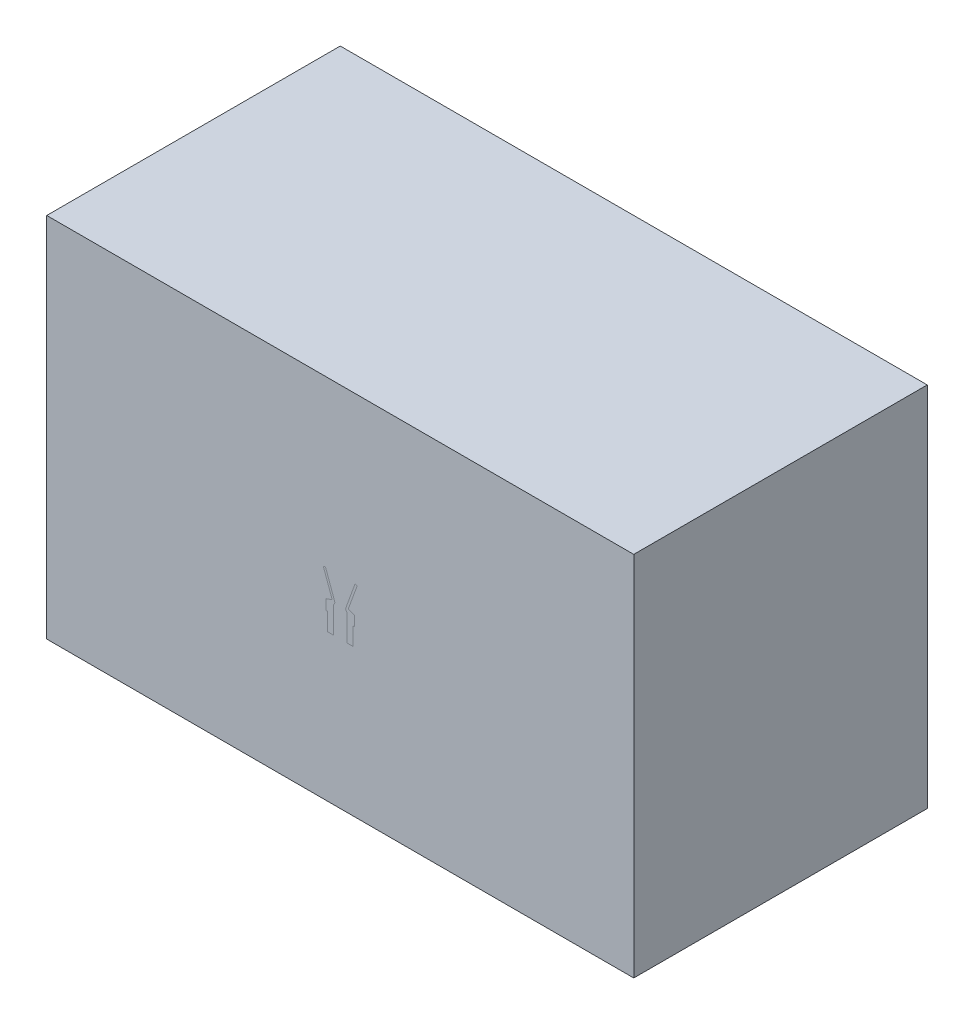
ISO-10303-21;
HEADER;
FILE_DESCRIPTION(('STEP AP214'),'2;1');
FILE_NAME('part.step','',(''),(''),'','','');
FILE_SCHEMA(('AUTOMOTIVE_DESIGN { 1 0 10303 214 1 1 1 1 }'));
ENDSEC;
DATA;
#1=APPLICATION_CONTEXT('core data for automotive mechanical design processes');
#2=APPLICATION_PROTOCOL_DEFINITION('international standard','automotive_design',2000,#1);
#3=PRODUCT_CONTEXT('',#1,'mechanical');
#4=PRODUCT('Part','Part','',(#3));
#5=PRODUCT_RELATED_PRODUCT_CATEGORY('part','',(#4));
#6=PRODUCT_DEFINITION_FORMATION('','',#4);
#7=PRODUCT_DEFINITION_CONTEXT('part definition',#1,'design');
#8=PRODUCT_DEFINITION('design','',#6,#7);
#9=PRODUCT_DEFINITION_SHAPE('','',#8);
#10=(LENGTH_UNIT() NAMED_UNIT(*) SI_UNIT(.MILLI.,.METRE.));
#11=(NAMED_UNIT(*) PLANE_ANGLE_UNIT() SI_UNIT($,.RADIAN.));
#12=(NAMED_UNIT(*) SI_UNIT($,.STERADIAN.) SOLID_ANGLE_UNIT());
#13=UNCERTAINTY_MEASURE_WITH_UNIT(LENGTH_MEASURE(1.E-05),#10,'distance_accuracy_value','');
#14=(GEOMETRIC_REPRESENTATION_CONTEXT(3) GLOBAL_UNCERTAINTY_ASSIGNED_CONTEXT((#13)) GLOBAL_UNIT_ASSIGNED_CONTEXT((#10,
#11,#12)) REPRESENTATION_CONTEXT('',''));
#15=CARTESIAN_POINT('',(0.,0.,0.));
#16=DIRECTION('',(0.,0.,1.));
#17=DIRECTION('',(1.,0.,0.));
#18=AXIS2_PLACEMENT_3D('',#15,#16,#17);
#19=CARTESIAN_POINT('',(0.,941.954291822987,0.));
#20=DIRECTION('',(0.,1.,0.));
#21=DIRECTION('',(0.,0.,1.));
#22=AXIS2_PLACEMENT_3D('',#19,#20,#21);
#23=TOROIDAL_SURFACE('',#22,265.023984913654,12.7);
#24=CARTESIAN_POINT('',(0.,946.297947643223,0.));
#25=DIRECTION('',(0.,-1.,0.));
#26=DIRECTION('',(0.,0.,-1.));
#27=AXIS2_PLACEMENT_3D('',#24,#25,#26);
#28=CIRCLE('',#27,253.089888629673);
#29=CARTESIAN_POINT('',(253.089888629673,946.297947643223,0.));
#30=VERTEX_POINT('',#29);
#31=CARTESIAN_POINT('',(-253.089888629673,946.297947643223,0.));
#32=VERTEX_POINT('',#31);
#33=EDGE_CURVE('E175',#30,#32,#28,.F.);
#34=ORIENTED_EDGE('',*,*,#33,.F.);
#35=CARTESIAN_POINT('',(265.023984913654,941.954291822987,0.));
#36=DIRECTION('',(0.,0.,1.));
#37=DIRECTION('',(1.,0.,0.));
#38=AXIS2_PLACEMENT_3D('',#35,#36,#37);
#39=CIRCLE('',#38,12.7);
#40=CARTESIAN_POINT('',(269.36764073389,953.888388106968,0.));
#41=VERTEX_POINT('',#40);
#42=EDGE_CURVE('E214',#30,#41,#39,.F.);
#43=ORIENTED_EDGE('',*,*,#42,.T.);
#44=CARTESIAN_POINT('',(0.,953.888388106968,0.));
#45=DIRECTION('',(0.,1.,0.));
#46=DIRECTION('',(0.,0.,1.));
#47=AXIS2_PLACEMENT_3D('',#44,#45,#46);
#48=CIRCLE('',#47,269.36764073389);
#49=CARTESIAN_POINT('',(-269.36764073389,953.888388106968,0.));
#50=VERTEX_POINT('',#49);
#51=EDGE_CURVE('E169',#50,#41,#48,.F.);
#52=ORIENTED_EDGE('',*,*,#51,.F.);
#53=CARTESIAN_POINT('',(-265.023984913654,941.954291822987,0.));
#54=DIRECTION('',(0.,0.,1.));
#55=DIRECTION('',(1.,0.,0.));
#56=AXIS2_PLACEMENT_3D('',#53,#54,#55);
#57=CIRCLE('',#56,12.7);
#58=EDGE_CURVE('E177',#50,#32,#57,.F.);
#59=ORIENTED_EDGE('',*,*,#58,.T.);
#60=EDGE_LOOP('',(#34,#43,#52,#59));
#61=FACE_BOUND('',#60,.T.);
#62=ADVANCED_FACE('F53',(#61),#23,.T.);
#63=CARTESIAN_POINT('',(0.,937.610636002752,0.));
#64=DIRECTION('',(0.,1.,0.));
#65=DIRECTION('',(0.,0.,1.));
#66=AXIS2_PLACEMENT_3D('',#63,#64,#65);
#67=TOROIDAL_SURFACE('',#66,276.958081197635,12.7);
#68=CARTESIAN_POINT('',(0.,949.544732286733,0.));
#69=DIRECTION('',(0.,1.,0.));
#70=DIRECTION('',(0.,0.,1.));
#71=AXIS2_PLACEMENT_3D('',#68,#69,#70);
#72=CIRCLE('',#71,281.301737017871);
#73=CARTESIAN_POINT('',(281.301737017871,949.544732286733,0.));
#74=VERTEX_POINT('',#73);
#75=CARTESIAN_POINT('',(-281.301737017871,949.544732286733,0.));
#76=VERTEX_POINT('',#75);
#77=EDGE_CURVE('E172',#74,#76,#72,.T.);
#78=ORIENTED_EDGE('',*,*,#77,.F.);
#79=CARTESIAN_POINT('',(276.958081197635,937.610636002752,0.));
#80=DIRECTION('',(0.,0.,1.));
#81=DIRECTION('',(1.,0.,0.));
#82=AXIS2_PLACEMENT_3D('',#79,#80,#81);
#83=CIRCLE('',#82,12.7);
#84=CARTESIAN_POINT('',(288.892177481616,933.266980182516,0.));
#85=VERTEX_POINT('',#84);
#86=EDGE_CURVE('E242',#74,#85,#83,.F.);
#87=ORIENTED_EDGE('',*,*,#86,.T.);
#88=CARTESIAN_POINT('',(0.,933.266980182516,0.));
#89=DIRECTION('',(0.,-1.,0.));
#90=DIRECTION('',(0.,0.,-1.));
#91=AXIS2_PLACEMENT_3D('',#88,#89,#90);
#92=CIRCLE('',#91,288.892177481616);
#93=CARTESIAN_POINT('',(-288.892177481616,933.266980182516,0.));
#94=VERTEX_POINT('',#93);
#95=EDGE_CURVE('E163',#94,#85,#92,.T.);
#96=ORIENTED_EDGE('',*,*,#95,.F.);
#97=CARTESIAN_POINT('',(-276.958081197635,937.610636002752,0.));
#98=DIRECTION('',(0.,0.,1.));
#99=DIRECTION('',(1.,0.,0.));
#100=AXIS2_PLACEMENT_3D('',#97,#98,#99);
#101=CIRCLE('',#100,12.7);
#102=EDGE_CURVE('E226',#94,#76,#101,.F.);
#103=ORIENTED_EDGE('',*,*,#102,.T.);
#104=EDGE_LOOP('',(#78,#87,#96,#103));
#105=FACE_BOUND('',#104,.T.);
#106=ADVANCED_FACE('F235',(#105),#67,.T.);
#107=CARTESIAN_POINT('',(0.,501.45218115623,0.));
#108=DIRECTION('',(0.,-1.,0.));
#109=DIRECTION('',(0.,0.,-1.));
#110=AXIS2_PLACEMENT_3D('',#107,#108,#109);
#111=TOROIDAL_SURFACE('',#110,145.239501630853,50.8);
#112=CARTESIAN_POINT('',(0.,518.826804437174,0.));
#113=DIRECTION('',(0.,-1.,0.));
#114=DIRECTION('',(0.,0.,-1.));
#115=AXIS2_PLACEMENT_3D('',#112,#113,#114);
#116=CIRCLE('',#115,97.5031164949284);
#117=CARTESIAN_POINT('',(-97.5031164949284,518.826804437174,0.));
#118=VERTEX_POINT('',#117);
#119=CARTESIAN_POINT('',(97.5031164949284,518.826804437174,0.));
#120=VERTEX_POINT('',#119);
#121=EDGE_CURVE('E158',#118,#120,#116,.T.);
#122=ORIENTED_EDGE('',*,*,#121,.F.);
#123=CARTESIAN_POINT('',(-145.239501630853,501.45218115623,0.));
#124=DIRECTION('',(0.,0.,1.));
#125=DIRECTION('',(1.,0.,0.));
#126=AXIS2_PLACEMENT_3D('',#123,#124,#125);
#127=CIRCLE('',#126,50.8);
#128=CARTESIAN_POINT('',(-120.65,457.,0.));
#129=VERTEX_POINT('',#128);
#130=EDGE_CURVE('E224',#118,#129,#127,.F.);
#131=ORIENTED_EDGE('',*,*,#130,.T.);
#132=CARTESIAN_POINT('',(0.,457.,0.));
#133=DIRECTION('',(0.,1.,0.));
#134=DIRECTION('',(0.,0.,1.));
#135=AXIS2_PLACEMENT_3D('',#132,#133,#134);
#136=CIRCLE('',#135,120.65);
#137=CARTESIAN_POINT('',(120.65,457.,0.));
#138=VERTEX_POINT('',#137);
#139=EDGE_CURVE('E197',#138,#129,#136,.T.);
#140=ORIENTED_EDGE('',*,*,#139,.F.);
#141=CARTESIAN_POINT('',(145.239501630853,501.45218115623,0.));
#142=DIRECTION('',(0.,0.,1.));
#143=DIRECTION('',(1.,0.,0.));
#144=AXIS2_PLACEMENT_3D('',#141,#142,#143);
#145=CIRCLE('',#144,50.8);
#146=EDGE_CURVE('E244',#138,#120,#145,.F.);
#147=ORIENTED_EDGE('',*,*,#146,.T.);
#148=EDGE_LOOP('',(#122,#131,#140,#147));
#149=FACE_BOUND('',#148,.T.);
#150=ADVANCED_FACE('F281',(#149),#111,.T.);
#151=CARTESIAN_POINT('',(0.,457.,0.));
#152=DIRECTION('',(0.,1.,0.));
#153=DIRECTION('',(0.,0.,1.));
#154=AXIS2_PLACEMENT_3D('',#151,#152,#153);
#155=CONICAL_SURFACE('',#154,75.,0.349065850398861);
#156=DIRECTION('',(0.342020143325664,0.93969262078591,0.));
#157=VECTOR('',#156,1.);
#158=CARTESIAN_POINT('',(0.,250.9391935409,0.));
#159=LINE('',#158,#157);
#160=EDGE_CURVE('E241',#30,#120,#159,.F.);
#161=ORIENTED_EDGE('',*,*,#160,.F.);
#162=ORIENTED_EDGE('',*,*,#33,.T.);
#163=DIRECTION('',(0.342020143325664,-0.93969262078591,0.));
#164=VECTOR('',#163,1.);
#165=CARTESIAN_POINT('',(0.,250.9391935409,0.));
#166=LINE('',#165,#164);
#167=EDGE_CURVE('E183',#118,#32,#166,.F.);
#168=ORIENTED_EDGE('',*,*,#167,.F.);
#169=ORIENTED_EDGE('',*,*,#121,.T.);
#170=EDGE_LOOP('',(#161,#162,#168,#169));
#171=FACE_BOUND('',#170,.T.);
#172=ADVANCED_FACE('F273',(#171),#155,.F.);
#173=CARTESIAN_POINT('',(0.,958.232043927204,0.));
#174=DIRECTION('',(0.,-1.,0.));
#175=DIRECTION('',(0.,0.,-1.));
#176=AXIS2_PLACEMENT_3D('',#173,#174,#175);
#177=CONICAL_SURFACE('',#176,257.433544449909,1.22173047639604);
#178=DIRECTION('',(-0.93969262078591,-0.342020143325664,0.));
#179=VECTOR('',#178,1.);
#180=CARTESIAN_POINT('',(0.,1051.93019140862,0.));
#181=LINE('',#180,#179);
#182=EDGE_CURVE('E187',#50,#76,#181,.T.);
#183=ORIENTED_EDGE('',*,*,#182,.F.);
#184=ORIENTED_EDGE('',*,*,#51,.T.);
#185=DIRECTION('',(-0.93969262078591,0.342020143325664,0.));
#186=VECTOR('',#185,1.);
#187=CARTESIAN_POINT('',(0.,1051.93019140862,0.));
#188=LINE('',#187,#186);
#189=EDGE_CURVE('E239',#74,#41,#188,.T.);
#190=ORIENTED_EDGE('',*,*,#189,.F.);
#191=ORIENTED_EDGE('',*,*,#77,.T.);
#192=EDGE_LOOP('',(#183,#184,#190,#191));
#193=FACE_BOUND('',#192,.T.);
#194=ADVANCED_FACE('F238',(#193),#177,.T.);
#195=CARTESIAN_POINT('',(0.,945.201076466497,0.));
#196=DIRECTION('',(0.,1.,0.));
#197=DIRECTION('',(0.,0.,1.));
#198=AXIS2_PLACEMENT_3D('',#195,#196,#197);
#199=CONICAL_SURFACE('',#198,293.235833301852,0.34906585039886);
#200=DIRECTION('',(0.342020143325663,0.93969262078591,0.));
#201=VECTOR('',#200,1.);
#202=CARTESIAN_POINT('',(0.,139.542245894684,0.));
#203=LINE('',#202,#201);
#204=CARTESIAN_POINT('',(138.974740497211,521.372207285344,0.));
#205=VERTEX_POINT('',#204);
#206=EDGE_CURVE('E249',#205,#85,#203,.T.);
#207=ORIENTED_EDGE('',*,*,#206,.F.);
#208=CARTESIAN_POINT('',(0.,521.372207285344,0.));
#209=DIRECTION('',(0.,-1.,0.));
#210=DIRECTION('',(0.,0.,-1.));
#211=AXIS2_PLACEMENT_3D('',#208,#209,#210);
#212=CIRCLE('',#211,138.974740497211);
#213=CARTESIAN_POINT('',(-138.974740497211,521.372207285344,0.));
#214=VERTEX_POINT('',#213);
#215=EDGE_CURVE('E146',#214,#205,#212,.T.);
#216=ORIENTED_EDGE('',*,*,#215,.F.);
#217=DIRECTION('',(0.342020143325663,-0.93969262078591,0.));
#218=VECTOR('',#217,1.);
#219=CARTESIAN_POINT('',(0.,139.542245894684,0.));
#220=LINE('',#219,#218);
#221=EDGE_CURVE('E222',#94,#214,#220,.T.);
#222=ORIENTED_EDGE('',*,*,#221,.F.);
#223=ORIENTED_EDGE('',*,*,#95,.T.);
#224=EDGE_LOOP('',(#207,#216,#222,#223));
#225=FACE_BOUND('',#224,.T.);
#226=ADVANCED_FACE('F265',(#225),#199,.T.);
#227=CARTESIAN_POINT('',(0.,521.372207285344,0.));
#228=DIRECTION('',(0.,-1.,0.));
#229=DIRECTION('',(0.,0.,-1.));
#230=AXIS2_PLACEMENT_3D('',#227,#228,#229);
#231=CONICAL_SURFACE('',#230,138.974740497211,1.22173047639604);
#232=DIRECTION('',(-0.93969262078591,-0.342020143325664,0.));
#233=VECTOR('',#232,1.);
#234=CARTESIAN_POINT('',(0.,571.954876141198,0.));
#235=LINE('',#234,#233);
#236=CARTESIAN_POINT('',(-246.05,482.4,0.));
#237=VERTEX_POINT('',#236);
#238=EDGE_CURVE('E220',#214,#237,#235,.T.);
#239=ORIENTED_EDGE('',*,*,#238,.F.);
#240=ORIENTED_EDGE('',*,*,#215,.T.);
#241=DIRECTION('',(-0.93969262078591,0.342020143325664,0.));
#242=VECTOR('',#241,1.);
#243=CARTESIAN_POINT('',(0.,571.954876141198,0.));
#244=LINE('',#243,#242);
#245=CARTESIAN_POINT('',(246.05,482.4,0.));
#246=VERTEX_POINT('',#245);
#247=EDGE_CURVE('E251',#246,#205,#244,.T.);
#248=ORIENTED_EDGE('',*,*,#247,.F.);
#249=CARTESIAN_POINT('',(0.,482.4,0.));
#250=DIRECTION('',(0.,-1.,0.));
#251=DIRECTION('',(0.,0.,-1.));
#252=AXIS2_PLACEMENT_3D('',#249,#250,#251);
#253=CIRCLE('',#252,246.05);
#254=EDGE_CURVE('E193',#237,#246,#253,.T.);
#255=ORIENTED_EDGE('',*,*,#254,.F.);
#256=EDGE_LOOP('',(#239,#240,#248,#255));
#257=FACE_BOUND('',#256,.T.);
#258=ADVANCED_FACE('F260',(#257),#231,.T.);
#259=CARTESIAN_POINT('',(0.,0.,0.));
#260=DIRECTION('',(0.,-1.,0.));
#261=DIRECTION('',(0.,0.,-1.));
#262=AXIS2_PLACEMENT_3D('',#259,#260,#261);
#263=CYLINDRICAL_SURFACE('',#262,246.05);
#264=DIRECTION('',(0.,-1.,0.));
#265=VECTOR('',#264,1.);
#266=CARTESIAN_POINT('',(-246.05,0.,0.));
#267=LINE('',#266,#265);
#268=CARTESIAN_POINT('',(-246.05,307.,0.));
#269=VERTEX_POINT('',#268);
#270=EDGE_CURVE('E213',#237,#269,#267,.T.);
#271=ORIENTED_EDGE('',*,*,#270,.F.);
#272=ORIENTED_EDGE('',*,*,#254,.T.);
#273=DIRECTION('',(0.,-1.,0.));
#274=VECTOR('',#273,1.);
#275=CARTESIAN_POINT('',(246.05,0.,0.));
#276=LINE('',#275,#274);
#277=CARTESIAN_POINT('',(246.05,307.,0.));
#278=VERTEX_POINT('',#277);
#279=EDGE_CURVE('E153',#278,#246,#276,.F.);
#280=ORIENTED_EDGE('',*,*,#279,.F.);
#281=CARTESIAN_POINT('',(0.,307.,0.));
#282=DIRECTION('',(0.,-1.,0.));
#283=DIRECTION('',(0.,0.,-1.));
#284=AXIS2_PLACEMENT_3D('',#281,#282,#283);
#285=CIRCLE('',#284,246.05);
#286=EDGE_CURVE('E152',#269,#278,#285,.T.);
#287=ORIENTED_EDGE('',*,*,#286,.F.);
#288=EDGE_LOOP('',(#271,#272,#280,#287));
#289=FACE_BOUND('',#288,.T.);
#290=ADVANCED_FACE('F263',(#289),#263,.T.);
#291=CARTESIAN_POINT('',(-220.65,307.,0.));
#292=DIRECTION('',(0.,1.,0.));
#293=DIRECTION('',(0.,0.,1.));
#294=AXIS2_PLACEMENT_3D('',#291,#292,#293);
#295=PLANE('',#294);
#296=DIRECTION('',(1.,0.,0.));
#297=VECTOR('',#296,1.);
#298=CARTESIAN_POINT('',(-220.65,307.,0.));
#299=LINE('',#298,#297);
#300=CARTESIAN_POINT('',(-220.65,307.,0.));
#301=VERTEX_POINT('',#300);
#302=EDGE_CURVE('E75',#269,#301,#299,.T.);
#303=ORIENTED_EDGE('',*,*,#302,.F.);
#304=ORIENTED_EDGE('',*,*,#286,.T.);
#305=CARTESIAN_POINT('',(220.65,307.,0.));
#306=VERTEX_POINT('',#305);
#307=EDGE_CURVE('E140',#306,#278,#299,.T.);
#308=ORIENTED_EDGE('',*,*,#307,.F.);
#309=CARTESIAN_POINT('',(0.,307.,0.));
#310=DIRECTION('',(0.,1.,0.));
#311=DIRECTION('',(0.,0.,1.));
#312=AXIS2_PLACEMENT_3D('',#309,#310,#311);
#313=CIRCLE('',#312,220.65);
#314=EDGE_CURVE('E150',#306,#301,#313,.T.);
#315=ORIENTED_EDGE('',*,*,#314,.T.);
#316=EDGE_LOOP('',(#303,#304,#308,#315));
#317=FACE_BOUND('',#316,.T.);
#318=ADVANCED_FACE('F55',(#317),#295,.F.);
#319=CARTESIAN_POINT('',(0.,457.,0.));
#320=DIRECTION('',(0.,-1.,0.));
#321=DIRECTION('',(0.,0.,-1.));
#322=AXIS2_PLACEMENT_3D('',#319,#320,#321);
#323=CYLINDRICAL_SURFACE('',#322,120.65);
#324=ORIENTED_EDGE('',*,*,#139,.T.);
#325=DIRECTION('',(0.,-1.,0.));
#326=VECTOR('',#325,1.);
#327=CARTESIAN_POINT('',(-120.65,457.,0.));
#328=LINE('',#327,#326);
#329=CARTESIAN_POINT('',(-120.65,0.,0.));
#330=VERTEX_POINT('',#329);
#331=EDGE_CURVE('E210',#129,#330,#328,.T.);
#332=ORIENTED_EDGE('',*,*,#331,.T.);
#333=CARTESIAN_POINT('',(0.,0.,0.));
#334=DIRECTION('',(0.,1.,0.));
#335=DIRECTION('',(0.,0.,1.));
#336=AXIS2_PLACEMENT_3D('',#333,#334,#335);
#337=CIRCLE('',#336,120.65);
#338=CARTESIAN_POINT('',(120.65,0.,0.));
#339=VERTEX_POINT('',#338);
#340=EDGE_CURVE('E160',#339,#330,#337,.T.);
#341=ORIENTED_EDGE('',*,*,#340,.F.);
#342=DIRECTION('',(0.,-1.,0.));
#343=VECTOR('',#342,1.);
#344=CARTESIAN_POINT('',(120.65,457.,0.));
#345=LINE('',#344,#343);
#346=EDGE_CURVE('E154',#339,#138,#345,.F.);
#347=ORIENTED_EDGE('',*,*,#346,.T.);
#348=EDGE_LOOP('',(#324,#332,#341,#347));
#349=FACE_BOUND('',#348,.T.);
#350=ADVANCED_FACE('F208',(#349),#323,.F.);
#351=CARTESIAN_POINT('',(0.,0.,0.));
#352=DIRECTION('',(0.,1.,0.));
#353=DIRECTION('',(0.,0.,1.));
#354=AXIS2_PLACEMENT_3D('',#351,#352,#353);
#355=PLANE('',#354);
#356=DIRECTION('',(1.,0.,0.));
#357=VECTOR('',#356,1.);
#358=CARTESIAN_POINT('',(0.,0.,0.));
#359=LINE('',#358,#357);
#360=CARTESIAN_POINT('',(-220.65,0.,0.));
#361=VERTEX_POINT('',#360);
#362=EDGE_CURVE('E204',#361,#330,#359,.T.);
#363=ORIENTED_EDGE('',*,*,#362,.F.);
#364=CARTESIAN_POINT('',(0.,0.,0.));
#365=DIRECTION('',(0.,1.,0.));
#366=DIRECTION('',(0.,0.,1.));
#367=AXIS2_PLACEMENT_3D('',#364,#365,#366);
#368=CIRCLE('',#367,220.65);
#369=CARTESIAN_POINT('',(220.65,0.,0.));
#370=VERTEX_POINT('',#369);
#371=EDGE_CURVE('E157',#370,#361,#368,.T.);
#372=ORIENTED_EDGE('',*,*,#371,.F.);
#373=EDGE_CURVE('E68',#339,#370,#359,.T.);
#374=ORIENTED_EDGE('',*,*,#373,.F.);
#375=ORIENTED_EDGE('',*,*,#340,.T.);
#376=EDGE_LOOP('',(#363,#372,#374,#375));
#377=FACE_BOUND('',#376,.T.);
#378=ADVANCED_FACE('F203',(#377),#355,.F.);
#379=CARTESIAN_POINT('',(0.,457.,0.));
#380=DIRECTION('',(0.,-1.,0.));
#381=DIRECTION('',(0.,0.,-1.));
#382=AXIS2_PLACEMENT_3D('',#379,#380,#381);
#383=CYLINDRICAL_SURFACE('',#382,220.65);
#384=DIRECTION('',(0.,-1.,0.));
#385=VECTOR('',#384,1.);
#386=CARTESIAN_POINT('',(-220.65,457.,0.));
#387=LINE('',#386,#385);
#388=EDGE_CURVE('E12',#301,#361,#387,.T.);
#389=ORIENTED_EDGE('',*,*,#388,.F.);
#390=ORIENTED_EDGE('',*,*,#314,.F.);
#391=DIRECTION('',(0.,-1.,0.));
#392=VECTOR('',#391,1.);
#393=CARTESIAN_POINT('',(220.65,457.,0.));
#394=LINE('',#393,#392);
#395=EDGE_CURVE('E61',#370,#306,#394,.F.);
#396=ORIENTED_EDGE('',*,*,#395,.F.);
#397=ORIENTED_EDGE('',*,*,#371,.T.);
#398=EDGE_LOOP('',(#389,#390,#396,#397));
#399=FACE_BOUND('',#398,.T.);
#400=ADVANCED_FACE('F156',(#399),#383,.T.);
#401=CARTESIAN_POINT('',(0.,0.,0.));
#402=DIRECTION('',(0.,0.,1.));
#403=DIRECTION('',(1.,0.,0.));
#404=AXIS2_PLACEMENT_3D('',#401,#402,#403);
#405=PLANE('',#404);
#406=ORIENTED_EDGE('',*,*,#160,.T.);
#407=ORIENTED_EDGE('',*,*,#146,.F.);
#408=ORIENTED_EDGE('',*,*,#346,.F.);
#409=ORIENTED_EDGE('',*,*,#373,.T.);
#410=ORIENTED_EDGE('',*,*,#395,.T.);
#411=ORIENTED_EDGE('',*,*,#307,.T.);
#412=ORIENTED_EDGE('',*,*,#279,.T.);
#413=ORIENTED_EDGE('',*,*,#247,.T.);
#414=ORIENTED_EDGE('',*,*,#206,.T.);
#415=ORIENTED_EDGE('',*,*,#86,.F.);
#416=ORIENTED_EDGE('',*,*,#189,.T.);
#417=ORIENTED_EDGE('',*,*,#42,.F.);
#418=EDGE_LOOP('',(#406,#407,#408,#409,#410,#411,#412,#413,#414,#415,#416,#417));
#419=FACE_BOUND('',#418,.T.);
#420=ADVANCED_FACE('F139',(#419),#405,.T.);
#421=ORIENTED_EDGE('',*,*,#182,.T.);
#422=ORIENTED_EDGE('',*,*,#102,.F.);
#423=ORIENTED_EDGE('',*,*,#221,.T.);
#424=ORIENTED_EDGE('',*,*,#238,.T.);
#425=ORIENTED_EDGE('',*,*,#270,.T.);
#426=ORIENTED_EDGE('',*,*,#302,.T.);
#427=ORIENTED_EDGE('',*,*,#388,.T.);
#428=ORIENTED_EDGE('',*,*,#362,.T.);
#429=ORIENTED_EDGE('',*,*,#331,.F.);
#430=ORIENTED_EDGE('',*,*,#130,.F.);
#431=ORIENTED_EDGE('',*,*,#167,.T.);
#432=ORIENTED_EDGE('',*,*,#58,.F.);
#433=EDGE_LOOP('',(#421,#422,#423,#424,#425,#426,#427,#428,#429,#430,#431,#432));
#434=FACE_BOUND('',#433,.T.);
#435=ADVANCED_FACE('F229',(#434),#405,.T.);
#436=CLOSED_SHELL('',(#62,#106,#150,#172,#194,#226,#258,#290,#318,#350,#378,#400,#420,#435));
#437=MANIFOLD_SOLID_BREP('B2',#436);
#438=CARTESIAN_POINT('',(0.,941.954291822987,0.));
#439=DIRECTION('',(0.,1.,0.));
#440=DIRECTION('',(0.,0.,1.));
#441=AXIS2_PLACEMENT_3D('',#438,#439,#440);
#442=TOROIDAL_SURFACE('',#441,265.023984913654,12.7);
#443=CARTESIAN_POINT('',(265.023984913654,941.954291822987,0.));
#444=DIRECTION('',(0.,0.,1.));
#445=DIRECTION('',(1.,0.,0.));
#446=AXIS2_PLACEMENT_3D('',#443,#444,#445);
#447=CIRCLE('',#446,12.7);
#448=CARTESIAN_POINT('',(253.089888629673,946.297947643223,0.));
#449=VERTEX_POINT('',#448);
#450=CARTESIAN_POINT('',(269.36764073389,953.888388106968,0.));
#451=VERTEX_POINT('',#450);
#452=EDGE_CURVE('E627',#449,#451,#447,.F.);
#453=ORIENTED_EDGE('',*,*,#452,.F.);
#454=CARTESIAN_POINT('',(0.,946.297947643223,0.));
#455=DIRECTION('',(0.,-1.,0.));
#456=DIRECTION('',(0.,0.,-1.));
#457=AXIS2_PLACEMENT_3D('',#454,#455,#456);
#458=CIRCLE('',#457,253.089888629673);
#459=CARTESIAN_POINT('',(-253.089888629673,946.297947643223,0.));
#460=VERTEX_POINT('',#459);
#461=EDGE_CURVE('E573',#449,#460,#458,.F.);
#462=ORIENTED_EDGE('',*,*,#461,.T.);
#463=CARTESIAN_POINT('',(-265.023984913654,941.954291822987,0.));
#464=DIRECTION('',(0.,0.,1.));
#465=DIRECTION('',(1.,0.,0.));
#466=AXIS2_PLACEMENT_3D('',#463,#464,#465);
#467=CIRCLE('',#466,12.7);
#468=CARTESIAN_POINT('',(-269.36764073389,953.888388106968,0.));
#469=VERTEX_POINT('',#468);
#470=EDGE_CURVE('E655',#469,#460,#467,.F.);
#471=ORIENTED_EDGE('',*,*,#470,.F.);
#472=CARTESIAN_POINT('',(0.,953.888388106968,0.));
#473=DIRECTION('',(0.,1.,0.));
#474=DIRECTION('',(0.,0.,1.));
#475=AXIS2_PLACEMENT_3D('',#472,#473,#474);
#476=CIRCLE('',#475,269.36764073389);
#477=EDGE_CURVE('E565',#469,#451,#476,.F.);
#478=ORIENTED_EDGE('',*,*,#477,.T.);
#479=EDGE_LOOP('',(#453,#462,#471,#478));
#480=FACE_BOUND('',#479,.T.);
#481=ADVANCED_FACE('F413',(#480),#442,.F.);
#482=CARTESIAN_POINT('',(0.,937.610636002752,0.));
#483=DIRECTION('',(0.,1.,0.));
#484=DIRECTION('',(0.,0.,1.));
#485=AXIS2_PLACEMENT_3D('',#482,#483,#484);
#486=TOROIDAL_SURFACE('',#485,276.958081197635,12.7);
#487=CARTESIAN_POINT('',(276.958081197635,937.610636002752,0.));
#488=DIRECTION('',(0.,0.,1.));
#489=DIRECTION('',(1.,0.,0.));
#490=AXIS2_PLACEMENT_3D('',#487,#488,#489);
#491=CIRCLE('',#490,12.7);
#492=CARTESIAN_POINT('',(281.301737017871,949.544732286733,0.));
#493=VERTEX_POINT('',#492);
#494=CARTESIAN_POINT('',(288.892177481616,933.266980182516,0.));
#495=VERTEX_POINT('',#494);
#496=EDGE_CURVE('E729',#493,#495,#491,.F.);
#497=ORIENTED_EDGE('',*,*,#496,.F.);
#498=CARTESIAN_POINT('',(0.,949.544732286733,0.));
#499=DIRECTION('',(0.,1.,0.));
#500=DIRECTION('',(0.,0.,1.));
#501=AXIS2_PLACEMENT_3D('',#498,#499,#500);
#502=CIRCLE('',#501,281.301737017871);
#503=CARTESIAN_POINT('',(-281.301737017871,949.544732286733,0.));
#504=VERTEX_POINT('',#503);
#505=EDGE_CURVE('E569',#493,#504,#502,.T.);
#506=ORIENTED_EDGE('',*,*,#505,.T.);
#507=CARTESIAN_POINT('',(-276.958081197635,937.610636002752,0.));
#508=DIRECTION('',(0.,0.,1.));
#509=DIRECTION('',(1.,0.,0.));
#510=AXIS2_PLACEMENT_3D('',#507,#508,#509);
#511=CIRCLE('',#510,12.7);
#512=CARTESIAN_POINT('',(-288.892177481616,933.266980182516,0.));
#513=VERTEX_POINT('',#512);
#514=EDGE_CURVE('E644',#513,#504,#511,.F.);
#515=ORIENTED_EDGE('',*,*,#514,.F.);
#516=CARTESIAN_POINT('',(0.,933.266980182516,0.));
#517=DIRECTION('',(0.,-1.,0.));
#518=DIRECTION('',(0.,0.,-1.));
#519=AXIS2_PLACEMENT_3D('',#516,#517,#518);
#520=CIRCLE('',#519,288.892177481616);
#521=EDGE_CURVE('E561',#513,#495,#520,.T.);
#522=ORIENTED_EDGE('',*,*,#521,.T.);
#523=EDGE_LOOP('',(#497,#506,#515,#522));
#524=FACE_BOUND('',#523,.T.);
#525=ADVANCED_FACE('F711',(#524),#486,.F.);
#526=CARTESIAN_POINT('',(0.,501.45218115623,0.));
#527=DIRECTION('',(0.,-1.,0.));
#528=DIRECTION('',(0.,0.,-1.));
#529=AXIS2_PLACEMENT_3D('',#526,#527,#528);
#530=TOROIDAL_SURFACE('',#529,145.239501630853,50.8);
#531=CARTESIAN_POINT('',(-145.239501630853,501.45218115623,0.));
#532=DIRECTION('',(0.,0.,1.));
#533=DIRECTION('',(1.,0.,0.));
#534=AXIS2_PLACEMENT_3D('',#531,#532,#533);
#535=CIRCLE('',#534,50.8);
#536=CARTESIAN_POINT('',(-97.5031164949284,518.826804437174,0.));
#537=VERTEX_POINT('',#536);
#538=CARTESIAN_POINT('',(-120.65,457.,0.));
#539=VERTEX_POINT('',#538);
#540=EDGE_CURVE('E612',#537,#539,#535,.F.);
#541=ORIENTED_EDGE('',*,*,#540,.F.);
#542=CARTESIAN_POINT('',(0.,518.826804437174,0.));
#543=DIRECTION('',(0.,-1.,0.));
#544=DIRECTION('',(0.,0.,-1.));
#545=AXIS2_PLACEMENT_3D('',#542,#543,#544);
#546=CIRCLE('',#545,97.5031164949284);
#547=CARTESIAN_POINT('',(97.5031164949284,518.826804437174,0.));
#548=VERTEX_POINT('',#547);
#549=EDGE_CURVE('E554',#537,#548,#546,.T.);
#550=ORIENTED_EDGE('',*,*,#549,.T.);
#551=CARTESIAN_POINT('',(145.239501630853,501.45218115623,0.));
#552=DIRECTION('',(0.,0.,1.));
#553=DIRECTION('',(1.,0.,0.));
#554=AXIS2_PLACEMENT_3D('',#551,#552,#553);
#555=CIRCLE('',#554,50.8);
#556=CARTESIAN_POINT('',(120.65,457.,0.));
#557=VERTEX_POINT('',#556);
#558=EDGE_CURVE('E614',#557,#548,#555,.F.);
#559=ORIENTED_EDGE('',*,*,#558,.F.);
#560=CARTESIAN_POINT('',(0.,457.,0.));
#561=DIRECTION('',(0.,1.,0.));
#562=DIRECTION('',(0.,0.,1.));
#563=AXIS2_PLACEMENT_3D('',#560,#561,#562);
#564=CIRCLE('',#563,120.65);
#565=EDGE_CURVE('E552',#557,#539,#564,.T.);
#566=ORIENTED_EDGE('',*,*,#565,.T.);
#567=EDGE_LOOP('',(#541,#550,#559,#566));
#568=FACE_BOUND('',#567,.T.);
#569=ADVANCED_FACE('F611',(#568),#530,.F.);
#570=CARTESIAN_POINT('',(0.,457.,0.));
#571=DIRECTION('',(0.,1.,0.));
#572=DIRECTION('',(0.,0.,1.));
#573=AXIS2_PLACEMENT_3D('',#570,#571,#572);
#574=CONICAL_SURFACE('',#573,75.,0.349065850398861);
#575=ORIENTED_EDGE('',*,*,#461,.F.);
#576=DIRECTION('',(0.342020143325664,0.93969262078591,0.));
#577=VECTOR('',#576,1.);
#578=CARTESIAN_POINT('',(0.,250.9391935409,0.));
#579=LINE('',#578,#577);
#580=EDGE_CURVE('E719',#449,#548,#579,.F.);
#581=ORIENTED_EDGE('',*,*,#580,.T.);
#582=ORIENTED_EDGE('',*,*,#549,.F.);
#583=DIRECTION('',(0.342020143325664,-0.93969262078591,0.));
#584=VECTOR('',#583,1.);
#585=CARTESIAN_POINT('',(0.,250.9391935409,0.));
#586=LINE('',#585,#584);
#587=EDGE_CURVE('E651',#537,#460,#586,.F.);
#588=ORIENTED_EDGE('',*,*,#587,.T.);
#589=EDGE_LOOP('',(#575,#581,#582,#588));
#590=FACE_BOUND('',#589,.T.);
#591=ADVANCED_FACE('F722',(#590),#574,.T.);
#592=CARTESIAN_POINT('',(0.,958.232043927204,0.));
#593=DIRECTION('',(0.,-1.,0.));
#594=DIRECTION('',(0.,0.,-1.));
#595=AXIS2_PLACEMENT_3D('',#592,#593,#594);
#596=CONICAL_SURFACE('',#595,257.433544449909,1.22173047639604);
#597=ORIENTED_EDGE('',*,*,#477,.F.);
#598=DIRECTION('',(-0.93969262078591,-0.342020143325664,0.));
#599=VECTOR('',#598,1.);
#600=CARTESIAN_POINT('',(0.,1051.93019140862,0.));
#601=LINE('',#600,#599);
#602=EDGE_CURVE('E647',#469,#504,#601,.T.);
#603=ORIENTED_EDGE('',*,*,#602,.T.);
#604=ORIENTED_EDGE('',*,*,#505,.F.);
#605=DIRECTION('',(-0.93969262078591,0.342020143325664,0.));
#606=VECTOR('',#605,1.);
#607=CARTESIAN_POINT('',(0.,1051.93019140862,0.));
#608=LINE('',#607,#606);
#609=EDGE_CURVE('E726',#493,#451,#608,.T.);
#610=ORIENTED_EDGE('',*,*,#609,.T.);
#611=EDGE_LOOP('',(#597,#603,#604,#610));
#612=FACE_BOUND('',#611,.T.);
#613=ADVANCED_FACE('F724',(#612),#596,.F.);
#614=CARTESIAN_POINT('',(0.,945.201076466497,0.));
#615=DIRECTION('',(0.,1.,0.));
#616=DIRECTION('',(0.,0.,1.));
#617=AXIS2_PLACEMENT_3D('',#614,#615,#616);
#618=CONICAL_SURFACE('',#617,293.235833301852,0.34906585039886);
#619=CARTESIAN_POINT('',(0.,521.372207285344,0.));
#620=DIRECTION('',(0.,-1.,0.));
#621=DIRECTION('',(0.,0.,-1.));
#622=AXIS2_PLACEMENT_3D('',#619,#620,#621);
#623=CIRCLE('',#622,138.974740497211);
#624=CARTESIAN_POINT('',(-138.974740497211,521.372207285344,0.));
#625=VERTEX_POINT('',#624);
#626=CARTESIAN_POINT('',(138.974740497211,521.372207285344,0.));
#627=VERTEX_POINT('',#626);
#628=EDGE_CURVE('E533',#625,#627,#623,.T.);
#629=ORIENTED_EDGE('',*,*,#628,.T.);
#630=DIRECTION('',(0.342020143325663,0.93969262078591,0.));
#631=VECTOR('',#630,1.);
#632=CARTESIAN_POINT('',(0.,139.542245894684,0.));
#633=LINE('',#632,#631);
#634=EDGE_CURVE('E737',#627,#495,#633,.T.);
#635=ORIENTED_EDGE('',*,*,#634,.T.);
#636=ORIENTED_EDGE('',*,*,#521,.F.);
#637=DIRECTION('',(0.342020143325663,-0.93969262078591,0.));
#638=VECTOR('',#637,1.);
#639=CARTESIAN_POINT('',(0.,139.542245894684,0.));
#640=LINE('',#639,#638);
#641=EDGE_CURVE('E638',#513,#625,#640,.T.);
#642=ORIENTED_EDGE('',*,*,#641,.T.);
#643=EDGE_LOOP('',(#629,#635,#636,#642));
#644=FACE_BOUND('',#643,.T.);
#645=ADVANCED_FACE('F761',(#644),#618,.F.);
#646=CARTESIAN_POINT('',(0.,521.372207285344,0.));
#647=DIRECTION('',(0.,-1.,0.));
#648=DIRECTION('',(0.,0.,-1.));
#649=AXIS2_PLACEMENT_3D('',#646,#647,#648);
#650=CONICAL_SURFACE('',#649,138.974740497211,1.22173047639604);
#651=ORIENTED_EDGE('',*,*,#628,.F.);
#652=DIRECTION('',(-0.93969262078591,-0.342020143325664,0.));
#653=VECTOR('',#652,1.);
#654=CARTESIAN_POINT('',(0.,571.954876141198,0.));
#655=LINE('',#654,#653);
#656=CARTESIAN_POINT('',(-246.05,482.4,0.));
#657=VERTEX_POINT('',#656);
#658=EDGE_CURVE('E634',#625,#657,#655,.T.);
#659=ORIENTED_EDGE('',*,*,#658,.T.);
#660=CARTESIAN_POINT('',(0.,482.4,0.));
#661=DIRECTION('',(0.,-1.,0.));
#662=DIRECTION('',(0.,0.,-1.));
#663=AXIS2_PLACEMENT_3D('',#660,#661,#662);
#664=CIRCLE('',#663,246.05);
#665=CARTESIAN_POINT('',(246.05,482.4,0.));
#666=VERTEX_POINT('',#665);
#667=EDGE_CURVE('E598',#657,#666,#664,.T.);
#668=ORIENTED_EDGE('',*,*,#667,.T.);
#669=DIRECTION('',(-0.93969262078591,0.342020143325664,0.));
#670=VECTOR('',#669,1.);
#671=CARTESIAN_POINT('',(0.,571.954876141198,0.));
#672=LINE('',#671,#670);
#673=EDGE_CURVE('E741',#666,#627,#672,.T.);
#674=ORIENTED_EDGE('',*,*,#673,.T.);
#675=EDGE_LOOP('',(#651,#659,#668,#674));
#676=FACE_BOUND('',#675,.T.);
#677=ADVANCED_FACE('F759',(#676),#650,.F.);
#678=CARTESIAN_POINT('',(0.,0.,0.));
#679=DIRECTION('',(0.,-1.,0.));
#680=DIRECTION('',(0.,0.,-1.));
#681=AXIS2_PLACEMENT_3D('',#678,#679,#680);
#682=CYLINDRICAL_SURFACE('',#681,246.05);
#683=ORIENTED_EDGE('',*,*,#667,.F.);
#684=DIRECTION('',(0.,-1.,0.));
#685=VECTOR('',#684,1.);
#686=CARTESIAN_POINT('',(-246.05,0.,0.));
#687=LINE('',#686,#685);
#688=CARTESIAN_POINT('',(-246.05,307.,0.));
#689=VERTEX_POINT('',#688);
#690=EDGE_CURVE('E625',#657,#689,#687,.T.);
#691=ORIENTED_EDGE('',*,*,#690,.T.);
#692=CARTESIAN_POINT('',(0.,307.,0.));
#693=DIRECTION('',(0.,-1.,0.));
#694=DIRECTION('',(0.,0.,-1.));
#695=AXIS2_PLACEMENT_3D('',#692,#693,#694);
#696=CIRCLE('',#695,246.05);
#697=CARTESIAN_POINT('',(246.05,307.,0.));
#698=VERTEX_POINT('',#697);
#699=EDGE_CURVE('E602',#689,#698,#696,.T.);
#700=ORIENTED_EDGE('',*,*,#699,.T.);
#701=DIRECTION('',(0.,-1.,0.));
#702=VECTOR('',#701,1.);
#703=CARTESIAN_POINT('',(246.05,0.,0.));
#704=LINE('',#703,#702);
#705=EDGE_CURVE('E745',#698,#666,#704,.F.);
#706=ORIENTED_EDGE('',*,*,#705,.T.);
#707=EDGE_LOOP('',(#683,#691,#700,#706));
#708=FACE_BOUND('',#707,.T.);
#709=ADVANCED_FACE('F756',(#708),#682,.F.);
#710=CARTESIAN_POINT('',(-220.65,307.,0.));
#711=DIRECTION('',(0.,1.,0.));
#712=DIRECTION('',(0.,0.,1.));
#713=AXIS2_PLACEMENT_3D('',#710,#711,#712);
#714=PLANE('',#713);
#715=ORIENTED_EDGE('',*,*,#699,.F.);
#716=DIRECTION('',(1.,0.,0.));
#717=VECTOR('',#716,1.);
#718=CARTESIAN_POINT('',(-220.65,307.,0.));
#719=LINE('',#718,#717);
#720=CARTESIAN_POINT('',(-220.65,307.,0.));
#721=VERTEX_POINT('',#720);
#722=EDGE_CURVE('E620',#689,#721,#719,.T.);
#723=ORIENTED_EDGE('',*,*,#722,.T.);
#724=CARTESIAN_POINT('',(0.,307.,0.));
#725=DIRECTION('',(0.,1.,0.));
#726=DIRECTION('',(0.,0.,1.));
#727=AXIS2_PLACEMENT_3D('',#724,#725,#726);
#728=CIRCLE('',#727,220.65);
#729=CARTESIAN_POINT('',(220.65,307.,0.));
#730=VERTEX_POINT('',#729);
#731=EDGE_CURVE('E548',#730,#721,#728,.T.);
#732=ORIENTED_EDGE('',*,*,#731,.F.);
#733=EDGE_CURVE('E436',#730,#698,#719,.T.);
#734=ORIENTED_EDGE('',*,*,#733,.T.);
#735=EDGE_LOOP('',(#715,#723,#732,#734));
#736=FACE_BOUND('',#735,.T.);
#737=ADVANCED_FACE('F753',(#736),#714,.T.);
#738=CARTESIAN_POINT('',(0.,457.,0.));
#739=DIRECTION('',(0.,-1.,0.));
#740=DIRECTION('',(0.,0.,-1.));
#741=AXIS2_PLACEMENT_3D('',#738,#739,#740);
#742=CYLINDRICAL_SURFACE('',#741,120.65);
#743=DIRECTION('',(0.,-1.,0.));
#744=VECTOR('',#743,1.);
#745=CARTESIAN_POINT('',(-120.65,457.,0.));
#746=LINE('',#745,#744);
#747=CARTESIAN_POINT('',(-120.65,0.,0.));
#748=VERTEX_POINT('',#747);
#749=EDGE_CURVE('E618',#539,#748,#746,.T.);
#750=ORIENTED_EDGE('',*,*,#749,.F.);
#751=ORIENTED_EDGE('',*,*,#565,.F.);
#752=DIRECTION('',(0.,-1.,0.));
#753=VECTOR('',#752,1.);
#754=CARTESIAN_POINT('',(120.65,457.,0.));
#755=LINE('',#754,#753);
#756=CARTESIAN_POINT('',(120.65,0.,0.));
#757=VERTEX_POINT('',#756);
#758=EDGE_CURVE('E543',#757,#557,#755,.F.);
#759=ORIENTED_EDGE('',*,*,#758,.F.);
#760=CARTESIAN_POINT('',(0.,0.,0.));
#761=DIRECTION('',(0.,1.,0.));
#762=DIRECTION('',(0.,0.,1.));
#763=AXIS2_PLACEMENT_3D('',#760,#761,#762);
#764=CIRCLE('',#763,120.65);
#765=EDGE_CURVE('E541',#757,#748,#764,.T.);
#766=ORIENTED_EDGE('',*,*,#765,.T.);
#767=EDGE_LOOP('',(#750,#751,#759,#766));
#768=FACE_BOUND('',#767,.T.);
#769=ADVANCED_FACE('F617',(#768),#742,.T.);
#770=CARTESIAN_POINT('',(0.,0.,0.));
#771=DIRECTION('',(0.,1.,0.));
#772=DIRECTION('',(0.,0.,1.));
#773=AXIS2_PLACEMENT_3D('',#770,#771,#772);
#774=PLANE('',#773);
#775=CARTESIAN_POINT('',(0.,0.,0.));
#776=DIRECTION('',(0.,1.,0.));
#777=DIRECTION('',(0.,0.,1.));
#778=AXIS2_PLACEMENT_3D('',#775,#776,#777);
#779=CIRCLE('',#778,220.65);
#780=CARTESIAN_POINT('',(220.65,0.,0.));
#781=VERTEX_POINT('',#780);
#782=CARTESIAN_POINT('',(-220.65,0.,0.));
#783=VERTEX_POINT('',#782);
#784=EDGE_CURVE('E539',#781,#783,#779,.T.);
#785=ORIENTED_EDGE('',*,*,#784,.T.);
#786=DIRECTION('',(1.,0.,0.));
#787=VECTOR('',#786,1.);
#788=CARTESIAN_POINT('',(0.,0.,0.));
#789=LINE('',#788,#787);
#790=EDGE_CURVE('E545',#783,#748,#789,.T.);
#791=ORIENTED_EDGE('',*,*,#790,.T.);
#792=ORIENTED_EDGE('',*,*,#765,.F.);
#793=EDGE_CURVE('E526',#757,#781,#789,.T.);
#794=ORIENTED_EDGE('',*,*,#793,.T.);
#795=EDGE_LOOP('',(#785,#791,#792,#794));
#796=FACE_BOUND('',#795,.T.);
#797=ADVANCED_FACE('F537',(#796),#774,.T.);
#798=CARTESIAN_POINT('',(0.,457.,0.));
#799=DIRECTION('',(0.,-1.,0.));
#800=DIRECTION('',(0.,0.,-1.));
#801=AXIS2_PLACEMENT_3D('',#798,#799,#800);
#802=CYLINDRICAL_SURFACE('',#801,220.65);
#803=ORIENTED_EDGE('',*,*,#731,.T.);
#804=DIRECTION('',(0.,-1.,0.));
#805=VECTOR('',#804,1.);
#806=CARTESIAN_POINT('',(-220.65,457.,0.));
#807=LINE('',#806,#805);
#808=EDGE_CURVE('E51',#721,#783,#807,.T.);
#809=ORIENTED_EDGE('',*,*,#808,.T.);
#810=ORIENTED_EDGE('',*,*,#784,.F.);
#811=DIRECTION('',(0.,-1.,0.));
#812=VECTOR('',#811,1.);
#813=CARTESIAN_POINT('',(220.65,457.,0.));
#814=LINE('',#813,#812);
#815=EDGE_CURVE('E421',#781,#730,#814,.F.);
#816=ORIENTED_EDGE('',*,*,#815,.T.);
#817=EDGE_LOOP('',(#803,#809,#810,#816));
#818=FACE_BOUND('',#817,.T.);
#819=ADVANCED_FACE('F546',(#818),#802,.F.);
#820=CARTESIAN_POINT('',(0.,0.,0.));
#821=DIRECTION('',(0.,0.,1.));
#822=DIRECTION('',(1.,0.,0.));
#823=AXIS2_PLACEMENT_3D('',#820,#821,#822);
#824=PLANE('',#823);
#825=DIRECTION('',(-1.,0.,0.));
#826=VECTOR('',#825,1.);
#827=CARTESIAN_POINT('',(5080.,3810.,0.));
#828=LINE('',#827,#826);
#829=CARTESIAN_POINT('',(5080.,3810.,0.));
#830=VERTEX_POINT('',#829);
#831=CARTESIAN_POINT('',(-5080.,3810.,1.77635683940025E-12));
#832=VERTEX_POINT('',#831);
#833=EDGE_CURVE('E428',#830,#832,#828,.T.);
#834=ORIENTED_EDGE('',*,*,#833,.T.);
#835=DIRECTION('',(0.,-1.,0.));
#836=VECTOR('',#835,1.);
#837=CARTESIAN_POINT('',(-5080.,0.,0.));
#838=LINE('',#837,#836);
#839=CARTESIAN_POINT('',(-5080.,-2540.,0.));
#840=VERTEX_POINT('',#839);
#841=EDGE_CURVE('E658',#832,#840,#838,.T.);
#842=ORIENTED_EDGE('',*,*,#841,.T.);
#843=DIRECTION('',(1.,0.,0.));
#844=VECTOR('',#843,1.);
#845=CARTESIAN_POINT('',(5080.,-2540.,0.));
#846=LINE('',#845,#844);
#847=CARTESIAN_POINT('',(5080.,-2540.,0.));
#848=VERTEX_POINT('',#847);
#849=EDGE_CURVE('E663',#840,#848,#846,.T.);
#850=ORIENTED_EDGE('',*,*,#849,.T.);
#851=DIRECTION('',(0.,-1.,0.));
#852=VECTOR('',#851,1.);
#853=CARTESIAN_POINT('',(5080.,0.,0.));
#854=LINE('',#853,#852);
#855=EDGE_CURVE('E666',#830,#848,#854,.T.);
#856=ORIENTED_EDGE('',*,*,#855,.F.);
#857=EDGE_LOOP('',(#834,#842,#850,#856));
#858=FACE_BOUND('',#857,.T.);
#859=ORIENTED_EDGE('',*,*,#452,.T.);
#860=ORIENTED_EDGE('',*,*,#609,.F.);
#861=ORIENTED_EDGE('',*,*,#496,.T.);
#862=ORIENTED_EDGE('',*,*,#634,.F.);
#863=ORIENTED_EDGE('',*,*,#673,.F.);
#864=ORIENTED_EDGE('',*,*,#705,.F.);
#865=ORIENTED_EDGE('',*,*,#733,.F.);
#866=ORIENTED_EDGE('',*,*,#815,.F.);
#867=ORIENTED_EDGE('',*,*,#793,.F.);
#868=ORIENTED_EDGE('',*,*,#758,.T.);
#869=ORIENTED_EDGE('',*,*,#558,.T.);
#870=ORIENTED_EDGE('',*,*,#580,.F.);
#871=EDGE_LOOP('',(#859,#860,#861,#862,#863,#864,#865,#866,#867,#868,#869,#870));
#872=FACE_BOUND('',#871,.T.);
#873=ORIENTED_EDGE('',*,*,#470,.T.);
#874=ORIENTED_EDGE('',*,*,#587,.F.);
#875=ORIENTED_EDGE('',*,*,#540,.T.);
#876=ORIENTED_EDGE('',*,*,#749,.T.);
#877=ORIENTED_EDGE('',*,*,#790,.F.);
#878=ORIENTED_EDGE('',*,*,#808,.F.);
#879=ORIENTED_EDGE('',*,*,#722,.F.);
#880=ORIENTED_EDGE('',*,*,#690,.F.);
#881=ORIENTED_EDGE('',*,*,#658,.F.);
#882=ORIENTED_EDGE('',*,*,#641,.F.);
#883=ORIENTED_EDGE('',*,*,#514,.T.);
#884=ORIENTED_EDGE('',*,*,#602,.F.);
#885=EDGE_LOOP('',(#873,#874,#875,#876,#877,#878,#879,#880,#881,#882,#883,#884));
#886=FACE_BOUND('',#885,.T.);
#887=ADVANCED_FACE('F524',(#858,#872,#886),#824,.T.);
#888=CARTESIAN_POINT('',(5080.,-2540.,5080.));
#889=DIRECTION('',(0.,1.,0.));
#890=DIRECTION('',(0.,0.,1.));
#891=AXIS2_PLACEMENT_3D('',#888,#889,#890);
#892=PLANE('',#891);
#893=ORIENTED_EDGE('',*,*,#849,.F.);
#894=DIRECTION('',(0.,0.,-1.));
#895=VECTOR('',#894,1.);
#896=CARTESIAN_POINT('',(-5080.,-2540.,5080.));
#897=LINE('',#896,#895);
#898=CARTESIAN_POINT('',(-5080.,-2540.,-5080.));
#899=VERTEX_POINT('',#898);
#900=EDGE_CURVE('E670',#840,#899,#897,.T.);
#901=ORIENTED_EDGE('',*,*,#900,.T.);
#902=DIRECTION('',(-1.,0.,0.));
#903=VECTOR('',#902,1.);
#904=CARTESIAN_POINT('',(5080.,-2540.,-5080.));
#905=LINE('',#904,#903);
#906=CARTESIAN_POINT('',(5080.,-2540.,-5080.));
#907=VERTEX_POINT('',#906);
#908=EDGE_CURVE('E576',#907,#899,#905,.T.);
#909=ORIENTED_EDGE('',*,*,#908,.F.);
#910=DIRECTION('',(0.,0.,-1.));
#911=VECTOR('',#910,1.);
#912=CARTESIAN_POINT('',(5080.,-2540.,5080.));
#913=LINE('',#912,#911);
#914=EDGE_CURVE('E671',#848,#907,#913,.T.);
#915=ORIENTED_EDGE('',*,*,#914,.F.);
#916=EDGE_LOOP('',(#893,#901,#909,#915));
#917=FACE_BOUND('',#916,.T.);
#918=ADVANCED_FACE('F698',(#917),#892,.F.);
#919=CARTESIAN_POINT('',(5080.,3810.00000000001,5080.));
#920=DIRECTION('',(0.,-1.,0.));
#921=DIRECTION('',(0.,0.,-1.));
#922=AXIS2_PLACEMENT_3D('',#919,#920,#921);
#923=PLANE('',#922);
#924=ORIENTED_EDGE('',*,*,#833,.F.);
#925=DIRECTION('',(0.,0.,1.));
#926=VECTOR('',#925,1.);
#927=CARTESIAN_POINT('',(5080.,3810.00000000001,5080.));
#928=LINE('',#927,#926);
#929=CARTESIAN_POINT('',(5080.,3810.,-5080.));
#930=VERTEX_POINT('',#929);
#931=EDGE_CURVE('E591',#930,#830,#928,.T.);
#932=ORIENTED_EDGE('',*,*,#931,.F.);
#933=DIRECTION('',(-1.,0.,0.));
#934=VECTOR('',#933,1.);
#935=CARTESIAN_POINT('',(5080.,3810.,-5080.));
#936=LINE('',#935,#934);
#937=CARTESIAN_POINT('',(-5080.,3810.,-5080.));
#938=VERTEX_POINT('',#937);
#939=EDGE_CURVE('E583',#930,#938,#936,.T.);
#940=ORIENTED_EDGE('',*,*,#939,.T.);
#941=DIRECTION('',(0.,0.,1.));
#942=VECTOR('',#941,1.);
#943=CARTESIAN_POINT('',(-5080.,3810.00000000001,5080.));
#944=LINE('',#943,#942);
#945=EDGE_CURVE('E675',#938,#832,#944,.T.);
#946=ORIENTED_EDGE('',*,*,#945,.T.);
#947=EDGE_LOOP('',(#924,#932,#940,#946));
#948=FACE_BOUND('',#947,.T.);
#949=ADVANCED_FACE('F689',(#948),#923,.F.);
#950=CARTESIAN_POINT('',(5080.,0.,0.));
#951=DIRECTION('',(1.,0.,0.));
#952=DIRECTION('',(0.,0.,-1.));
#953=AXIS2_PLACEMENT_3D('',#950,#951,#952);
#954=PLANE('',#953);
#955=ORIENTED_EDGE('',*,*,#931,.T.);
#956=ORIENTED_EDGE('',*,*,#855,.T.);
#957=ORIENTED_EDGE('',*,*,#914,.T.);
#958=DIRECTION('',(0.,1.,0.));
#959=VECTOR('',#958,1.);
#960=CARTESIAN_POINT('',(5080.,3810.,-5080.));
#961=LINE('',#960,#959);
#962=EDGE_CURVE('E674',#907,#930,#961,.T.);
#963=ORIENTED_EDGE('',*,*,#962,.T.);
#964=EDGE_LOOP('',(#955,#956,#957,#963));
#965=FACE_BOUND('',#964,.T.);
#966=ADVANCED_FACE('F700',(#965),#954,.T.);
#967=CARTESIAN_POINT('',(-5080.,0.,0.));
#968=DIRECTION('',(1.,0.,0.));
#969=DIRECTION('',(0.,0.,-1.));
#970=AXIS2_PLACEMENT_3D('',#967,#968,#969);
#971=PLANE('',#970);
#972=ORIENTED_EDGE('',*,*,#841,.F.);
#973=ORIENTED_EDGE('',*,*,#945,.F.);
#974=DIRECTION('',(0.,1.,0.));
#975=VECTOR('',#974,1.);
#976=CARTESIAN_POINT('',(-5080.,3810.,-5080.));
#977=LINE('',#976,#975);
#978=EDGE_CURVE('E683',#899,#938,#977,.T.);
#979=ORIENTED_EDGE('',*,*,#978,.F.);
#980=ORIENTED_EDGE('',*,*,#900,.F.);
#981=EDGE_LOOP('',(#972,#973,#979,#980));
#982=FACE_BOUND('',#981,.T.);
#983=ADVANCED_FACE('F693',(#982),#971,.F.);
#984=CARTESIAN_POINT('',(5080.,3810.,-5080.));
#985=DIRECTION('',(0.,0.,1.));
#986=DIRECTION('',(0.,-1.,0.));
#987=AXIS2_PLACEMENT_3D('',#984,#985,#986);
#988=PLANE('',#987);
#989=ORIENTED_EDGE('',*,*,#978,.T.);
#990=ORIENTED_EDGE('',*,*,#939,.F.);
#991=ORIENTED_EDGE('',*,*,#962,.F.);
#992=ORIENTED_EDGE('',*,*,#908,.T.);
#993=EDGE_LOOP('',(#989,#990,#991,#992));
#994=FACE_BOUND('',#993,.T.);
#995=ADVANCED_FACE('F701',(#994),#988,.F.);
#996=CLOSED_SHELL('',(#481,#525,#569,#591,#613,#645,#677,#709,#737,#769,#797,#819,#887,#918,
#949,#966,#983,#995));
#997=MANIFOLD_SOLID_BREP('B6',#996);
#998=ADVANCED_BREP_SHAPE_REPRESENTATION('',(#18,#437,#997),#14);
#999=SHAPE_DEFINITION_REPRESENTATION(#9,#998);
ENDSEC;
END-ISO-10303-21;
